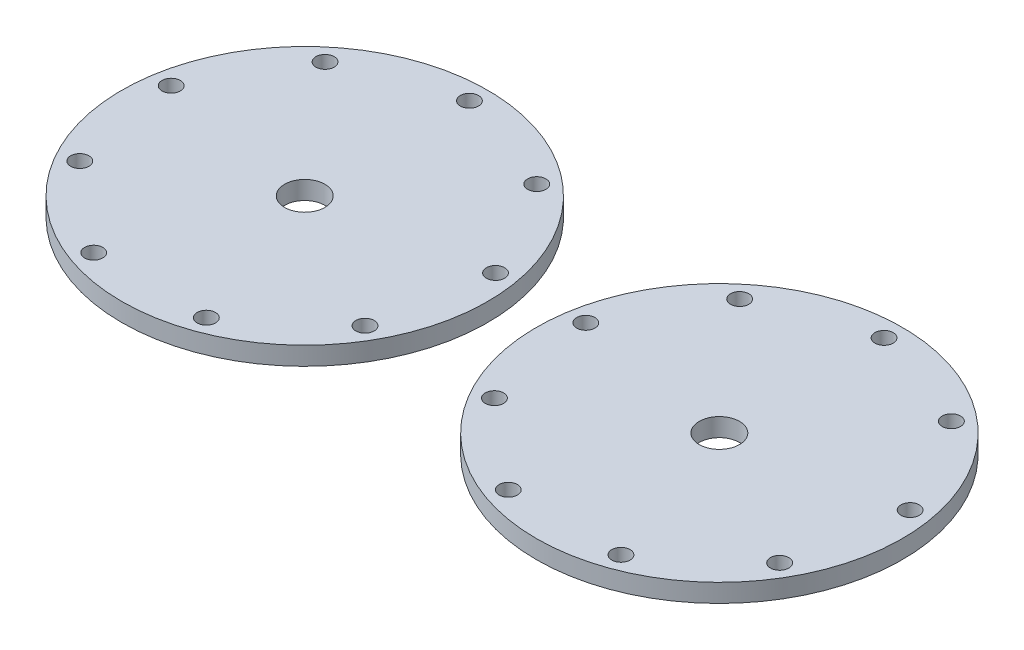
ISO-10303-21;
HEADER;
FILE_DESCRIPTION(('STEP AP214'),'2;1');
FILE_NAME('part.step','',(''),(''),'','','');
FILE_SCHEMA(('AUTOMOTIVE_DESIGN { 1 0 10303 214 1 1 1 1 }'));
ENDSEC;
DATA;
#1=APPLICATION_CONTEXT('core data for automotive mechanical design processes');
#2=APPLICATION_PROTOCOL_DEFINITION('international standard','automotive_design',2000,#1);
#3=PRODUCT_CONTEXT('',#1,'mechanical');
#4=PRODUCT('Part','Part','',(#3));
#5=PRODUCT_RELATED_PRODUCT_CATEGORY('part','',(#4));
#6=PRODUCT_DEFINITION_FORMATION('','',#4);
#7=PRODUCT_DEFINITION_CONTEXT('part definition',#1,'design');
#8=PRODUCT_DEFINITION('design','',#6,#7);
#9=PRODUCT_DEFINITION_SHAPE('','',#8);
#10=(LENGTH_UNIT() NAMED_UNIT(*) SI_UNIT(.MILLI.,.METRE.));
#11=(NAMED_UNIT(*) PLANE_ANGLE_UNIT() SI_UNIT($,.RADIAN.));
#12=(NAMED_UNIT(*) SI_UNIT($,.STERADIAN.) SOLID_ANGLE_UNIT());
#13=UNCERTAINTY_MEASURE_WITH_UNIT(LENGTH_MEASURE(1.E-05),#10,'distance_accuracy_value','');
#14=(GEOMETRIC_REPRESENTATION_CONTEXT(3) GLOBAL_UNCERTAINTY_ASSIGNED_CONTEXT((#13)) GLOBAL_UNIT_ASSIGNED_CONTEXT((#10,
#11,#12)) REPRESENTATION_CONTEXT('',''));
#15=CARTESIAN_POINT('',(0.,0.,0.));
#16=DIRECTION('',(0.,0.,1.));
#17=DIRECTION('',(1.,0.,0.));
#18=AXIS2_PLACEMENT_3D('',#15,#16,#17);
#19=CARTESIAN_POINT('',(-135.319032656499,6.,0.6431512958959));
#20=DIRECTION('',(0.,1.,0.));
#21=DIRECTION('',(0.,0.,1.));
#22=AXIS2_PLACEMENT_3D('',#19,#20,#21);
#23=PLANE('',#22);
#24=CARTESIAN_POINT('',(-188.498651319157,6.,-8.73385029811607));
#25=DIRECTION('',(0.,1.,0.));
#26=DIRECTION('',(0.,0.,1.));
#27=AXIS2_PLACEMENT_3D('',#24,#25,#26);
#28=CIRCLE('',#27,3.00000000000304);
#29=CARTESIAN_POINT('',(-188.498651319157,6.,-5.73385029811303));
#30=VERTEX_POINT('',#29);
#31=EDGE_CURVE('E115',#30,#30,#28,.T.);
#32=ORIENTED_EDGE('',*,*,#31,.F.);
#33=EDGE_LOOP('',(#32));
#34=FACE_BOUND('',#33,.T.);
#35=CARTESIAN_POINT('',(-153.788120396081,6.,51.3865528183357));
#36=DIRECTION('',(0.,1.,0.));
#37=DIRECTION('',(0.,0.,1.));
#38=AXIS2_PLACEMENT_3D('',#35,#36,#37);
#39=CIRCLE('',#38,3.0000000000049);
#40=CARTESIAN_POINT('',(-153.788120396081,6.,54.3865528183406));
#41=VERTEX_POINT('',#40);
#42=EDGE_CURVE('E119',#41,#41,#39,.T.);
#43=ORIENTED_EDGE('',*,*,#42,.F.);
#44=EDGE_LOOP('',(#43));
#45=FACE_BOUND('',#44,.T.);
#46=CARTESIAN_POINT('',(-88.5536608521361,6.,27.6431512958939));
#47=DIRECTION('',(0.,1.,0.));
#48=DIRECTION('',(0.,0.,1.));
#49=AXIS2_PLACEMENT_3D('',#46,#47,#48);
#50=CIRCLE('',#49,3.00000000000295);
#51=CARTESIAN_POINT('',(-88.5536608521361,6.,30.6431512958969));
#52=VERTEX_POINT('',#51);
#53=EDGE_CURVE('E123',#52,#52,#50,.T.);
#54=ORIENTED_EDGE('',*,*,#53,.F.);
#55=EDGE_LOOP('',(#54));
#56=FACE_BOUND('',#55,.T.);
#57=CARTESIAN_POINT('',(-100.608501733426,6.,-40.7232486325304));
#58=DIRECTION('',(0.,1.,0.));
#59=DIRECTION('',(0.,0.,1.));
#60=AXIS2_PLACEMENT_3D('',#57,#58,#59);
#61=CIRCLE('',#60,3.00000000000014);
#62=CARTESIAN_POINT('',(-100.608501733426,6.,-37.7232486325302));
#63=VERTEX_POINT('',#62);
#64=EDGE_CURVE('E81',#63,#63,#61,.T.);
#65=ORIENTED_EDGE('',*,*,#64,.F.);
#66=EDGE_LOOP('',(#65));
#67=FACE_BOUND('',#66,.T.);
#68=CARTESIAN_POINT('',(-135.319032656499,6.,-53.3568487041041));
#69=DIRECTION('',(0.,1.,0.));
#70=DIRECTION('',(0.,0.,1.));
#71=AXIS2_PLACEMENT_3D('',#68,#69,#70);
#72=CIRCLE('',#71,2.99999999999999);
#73=CARTESIAN_POINT('',(-135.319032656499,6.,-50.3568487041041));
#74=VERTEX_POINT('',#73);
#75=EDGE_CURVE('E59',#74,#74,#72,.T.);
#76=ORIENTED_EDGE('',*,*,#75,.F.);
#77=EDGE_LOOP('',(#76));
#78=FACE_BOUND('',#77,.T.);
#79=CARTESIAN_POINT('',(-135.319032656499,6.,0.6431512958959));
#80=DIRECTION('',(0.,1.,0.));
#81=DIRECTION('',(0.,0.,1.));
#82=AXIS2_PLACEMENT_3D('',#79,#80,#81);
#83=CIRCLE('',#82,60.);
#84=CARTESIAN_POINT('',(-135.319032656499,6.,60.6431512958959));
#85=VERTEX_POINT('',#84);
#86=EDGE_CURVE('E12',#85,#85,#83,.T.);
#87=ORIENTED_EDGE('',*,*,#86,.T.);
#88=EDGE_LOOP('',(#87));
#89=FACE_BOUND('',#88,.T.);
#90=CARTESIAN_POINT('',(-135.319032656499,6.,0.6431512958959));
#91=DIRECTION('',(0.,1.,0.));
#92=DIRECTION('',(0.,0.,1.));
#93=AXIS2_PLACEMENT_3D('',#90,#91,#92);
#94=CIRCLE('',#93,6.60000000000001);
#95=CARTESIAN_POINT('',(-135.319032656499,6.,7.24315129589591));
#96=VERTEX_POINT('',#95);
#97=EDGE_CURVE('E72',#96,#96,#94,.T.);
#98=ORIENTED_EDGE('',*,*,#97,.F.);
#99=EDGE_LOOP('',(#98));
#100=FACE_BOUND('',#99,.T.);
#101=CARTESIAN_POINT('',(-82.1394139938381,6.,-8.7338502981206));
#102=DIRECTION('',(0.,1.,0.));
#103=DIRECTION('',(0.,0.,1.));
#104=AXIS2_PLACEMENT_3D('',#101,#102,#103);
#105=CIRCLE('',#104,3.0000000000013);
#106=CARTESIAN_POINT('',(-82.1394139938381,6.,-5.7338502981193));
#107=VERTEX_POINT('',#106);
#108=EDGE_CURVE('E133',#107,#107,#105,.T.);
#109=ORIENTED_EDGE('',*,*,#108,.F.);
#110=EDGE_LOOP('',(#109));
#111=FACE_BOUND('',#110,.T.);
#112=CARTESIAN_POINT('',(-116.849944916909,6.,51.3865528183342));
#113=DIRECTION('',(0.,1.,0.));
#114=DIRECTION('',(0.,0.,1.));
#115=AXIS2_PLACEMENT_3D('',#112,#113,#114);
#116=CIRCLE('',#115,3.00000000000432);
#117=CARTESIAN_POINT('',(-116.849944916909,6.,54.3865528183385));
#118=VERTEX_POINT('',#117);
#119=EDGE_CURVE('E137',#118,#118,#116,.T.);
#120=ORIENTED_EDGE('',*,*,#119,.F.);
#121=EDGE_LOOP('',(#120));
#122=FACE_BOUND('',#121,.T.);
#123=CARTESIAN_POINT('',(-182.084404460855,6.,27.6431512958979));
#124=DIRECTION('',(0.,1.,0.));
#125=DIRECTION('',(0.,0.,1.));
#126=AXIS2_PLACEMENT_3D('',#123,#124,#125);
#127=CIRCLE('',#126,3.00000000000435);
#128=CARTESIAN_POINT('',(-182.084404460855,6.,30.6431512959023));
#129=VERTEX_POINT('',#128);
#130=EDGE_CURVE('E141',#129,#129,#127,.T.);
#131=ORIENTED_EDGE('',*,*,#130,.F.);
#132=EDGE_LOOP('',(#131));
#133=FACE_BOUND('',#132,.T.);
#134=CARTESIAN_POINT('',(-170.029563579572,6.,-40.7232486325274));
#135=DIRECTION('',(0.,1.,0.));
#136=DIRECTION('',(0.,0.,1.));
#137=AXIS2_PLACEMENT_3D('',#134,#135,#136);
#138=CIRCLE('',#137,3.00000000000159);
#139=CARTESIAN_POINT('',(-170.029563579572,6.,-37.7232486325258));
#140=VERTEX_POINT('',#139);
#141=EDGE_CURVE('E144',#140,#140,#138,.T.);
#142=ORIENTED_EDGE('',*,*,#141,.F.);
#143=EDGE_LOOP('',(#142));
#144=FACE_BOUND('',#143,.T.);
#145=ADVANCED_FACE('F45',(#34,#45,#56,#67,#78,#89,#100,#111,#122,#133,#144),#23,.T.);
#146=CARTESIAN_POINT('',(-135.319032656499,0.,0.6431512958959));
#147=DIRECTION('',(0.,1.,0.));
#148=DIRECTION('',(0.,0.,1.));
#149=AXIS2_PLACEMENT_3D('',#146,#147,#148);
#150=PLANE('',#149);
#151=CARTESIAN_POINT('',(-135.319032656499,0.,0.6431512958959));
#152=DIRECTION('',(0.,1.,0.));
#153=DIRECTION('',(0.,0.,1.));
#154=AXIS2_PLACEMENT_3D('',#151,#152,#153);
#155=CIRCLE('',#154,60.);
#156=CARTESIAN_POINT('',(-135.319032656499,0.,60.6431512958959));
#157=VERTEX_POINT('',#156);
#158=EDGE_CURVE('E49',#157,#157,#155,.T.);
#159=ORIENTED_EDGE('',*,*,#158,.F.);
#160=EDGE_LOOP('',(#159));
#161=FACE_BOUND('',#160,.T.);
#162=CARTESIAN_POINT('',(-135.319032656499,0.,-53.3568487041041));
#163=DIRECTION('',(0.,1.,0.));
#164=DIRECTION('',(0.,0.,1.));
#165=AXIS2_PLACEMENT_3D('',#162,#163,#164);
#166=CIRCLE('',#165,2.99999999999999);
#167=CARTESIAN_POINT('',(-135.319032656499,0.,-50.3568487041041));
#168=VERTEX_POINT('',#167);
#169=EDGE_CURVE('E62',#168,#168,#166,.T.);
#170=ORIENTED_EDGE('',*,*,#169,.T.);
#171=EDGE_LOOP('',(#170));
#172=FACE_BOUND('',#171,.T.);
#173=CARTESIAN_POINT('',(-135.319032656499,0.,0.6431512958959));
#174=DIRECTION('',(0.,1.,0.));
#175=DIRECTION('',(0.,0.,1.));
#176=AXIS2_PLACEMENT_3D('',#173,#174,#175);
#177=CIRCLE('',#176,6.60000000000001);
#178=CARTESIAN_POINT('',(-135.319032656499,0.,7.24315129589591));
#179=VERTEX_POINT('',#178);
#180=EDGE_CURVE('E77',#179,#179,#177,.T.);
#181=ORIENTED_EDGE('',*,*,#180,.T.);
#182=EDGE_LOOP('',(#181));
#183=FACE_BOUND('',#182,.T.);
#184=CARTESIAN_POINT('',(-100.608501733426,0.,-40.7232486325304));
#185=DIRECTION('',(0.,1.,0.));
#186=DIRECTION('',(0.,0.,1.));
#187=AXIS2_PLACEMENT_3D('',#184,#185,#186);
#188=CIRCLE('',#187,3.00000000000014);
#189=CARTESIAN_POINT('',(-100.608501733426,0.,-37.7232486325302));
#190=VERTEX_POINT('',#189);
#191=EDGE_CURVE('E78',#190,#190,#188,.T.);
#192=ORIENTED_EDGE('',*,*,#191,.T.);
#193=EDGE_LOOP('',(#192));
#194=FACE_BOUND('',#193,.T.);
#195=CARTESIAN_POINT('',(-82.1394139938381,0.,-8.7338502981206));
#196=DIRECTION('',(0.,1.,0.));
#197=DIRECTION('',(0.,0.,1.));
#198=AXIS2_PLACEMENT_3D('',#195,#196,#197);
#199=CIRCLE('',#198,3.0000000000013);
#200=CARTESIAN_POINT('',(-82.1394139938381,0.,-5.7338502981193));
#201=VERTEX_POINT('',#200);
#202=EDGE_CURVE('E221',#201,#201,#199,.T.);
#203=ORIENTED_EDGE('',*,*,#202,.T.);
#204=EDGE_LOOP('',(#203));
#205=FACE_BOUND('',#204,.T.);
#206=CARTESIAN_POINT('',(-88.5536608521361,0.,27.6431512958939));
#207=DIRECTION('',(0.,1.,0.));
#208=DIRECTION('',(0.,0.,1.));
#209=AXIS2_PLACEMENT_3D('',#206,#207,#208);
#210=CIRCLE('',#209,3.00000000000295);
#211=CARTESIAN_POINT('',(-88.5536608521361,0.,30.6431512958969));
#212=VERTEX_POINT('',#211);
#213=EDGE_CURVE('E176',#212,#212,#210,.T.);
#214=ORIENTED_EDGE('',*,*,#213,.T.);
#215=EDGE_LOOP('',(#214));
#216=FACE_BOUND('',#215,.T.);
#217=CARTESIAN_POINT('',(-116.849944916909,0.,51.3865528183342));
#218=DIRECTION('',(0.,1.,0.));
#219=DIRECTION('',(0.,0.,1.));
#220=AXIS2_PLACEMENT_3D('',#217,#218,#219);
#221=CIRCLE('',#220,3.00000000000432);
#222=CARTESIAN_POINT('',(-116.849944916909,0.,54.3865528183385));
#223=VERTEX_POINT('',#222);
#224=EDGE_CURVE('E169',#223,#223,#221,.T.);
#225=ORIENTED_EDGE('',*,*,#224,.T.);
#226=EDGE_LOOP('',(#225));
#227=FACE_BOUND('',#226,.T.);
#228=CARTESIAN_POINT('',(-153.788120396081,0.,51.3865528183357));
#229=DIRECTION('',(0.,1.,0.));
#230=DIRECTION('',(0.,0.,1.));
#231=AXIS2_PLACEMENT_3D('',#228,#229,#230);
#232=CIRCLE('',#231,3.0000000000049);
#233=CARTESIAN_POINT('',(-153.788120396081,0.,54.3865528183406));
#234=VERTEX_POINT('',#233);
#235=EDGE_CURVE('E170',#234,#234,#232,.T.);
#236=ORIENTED_EDGE('',*,*,#235,.T.);
#237=EDGE_LOOP('',(#236));
#238=FACE_BOUND('',#237,.T.);
#239=CARTESIAN_POINT('',(-182.084404460855,0.,27.6431512958979));
#240=DIRECTION('',(0.,1.,0.));
#241=DIRECTION('',(0.,0.,1.));
#242=AXIS2_PLACEMENT_3D('',#239,#240,#241);
#243=CIRCLE('',#242,3.00000000000435);
#244=CARTESIAN_POINT('',(-182.084404460855,0.,30.6431512959023));
#245=VERTEX_POINT('',#244);
#246=EDGE_CURVE('E158',#245,#245,#243,.T.);
#247=ORIENTED_EDGE('',*,*,#246,.T.);
#248=EDGE_LOOP('',(#247));
#249=FACE_BOUND('',#248,.T.);
#250=CARTESIAN_POINT('',(-188.498651319157,0.,-8.73385029811607));
#251=DIRECTION('',(0.,1.,0.));
#252=DIRECTION('',(0.,0.,1.));
#253=AXIS2_PLACEMENT_3D('',#250,#251,#252);
#254=CIRCLE('',#253,3.00000000000304);
#255=CARTESIAN_POINT('',(-188.498651319157,0.,-5.73385029811303));
#256=VERTEX_POINT('',#255);
#257=EDGE_CURVE('E147',#256,#256,#254,.T.);
#258=ORIENTED_EDGE('',*,*,#257,.T.);
#259=EDGE_LOOP('',(#258));
#260=FACE_BOUND('',#259,.T.);
#261=CARTESIAN_POINT('',(-170.029563579572,0.,-40.7232486325274));
#262=DIRECTION('',(0.,1.,0.));
#263=DIRECTION('',(0.,0.,1.));
#264=AXIS2_PLACEMENT_3D('',#261,#262,#263);
#265=CIRCLE('',#264,3.00000000000159);
#266=CARTESIAN_POINT('',(-170.029563579572,0.,-37.7232486325258));
#267=VERTEX_POINT('',#266);
#268=EDGE_CURVE('E148',#267,#267,#265,.T.);
#269=ORIENTED_EDGE('',*,*,#268,.T.);
#270=EDGE_LOOP('',(#269));
#271=FACE_BOUND('',#270,.T.);
#272=ADVANCED_FACE('F90',(#161,#172,#183,#194,#205,#216,#227,#238,#249,#260,#271),#150,.F.);
#273=CARTESIAN_POINT('',(-135.319032656499,6.,0.6431512958959));
#274=DIRECTION('',(0.,-1.,0.));
#275=DIRECTION('',(0.,0.,-1.));
#276=AXIS2_PLACEMENT_3D('',#273,#274,#275);
#277=CYLINDRICAL_SURFACE('',#276,60.);
#278=ORIENTED_EDGE('',*,*,#86,.F.);
#279=EDGE_LOOP('',(#278));
#280=FACE_BOUND('',#279,.T.);
#281=ORIENTED_EDGE('',*,*,#158,.T.);
#282=EDGE_LOOP('',(#281));
#283=FACE_BOUND('',#282,.T.);
#284=ADVANCED_FACE('F47',(#280,#283),#277,.T.);
#285=CARTESIAN_POINT('',(-135.319032656499,6.,-53.3568487041041));
#286=DIRECTION('',(0.,-1.,0.));
#287=DIRECTION('',(0.,0.,-1.));
#288=AXIS2_PLACEMENT_3D('',#285,#286,#287);
#289=CYLINDRICAL_SURFACE('',#288,2.99999999999999);
#290=ORIENTED_EDGE('',*,*,#75,.T.);
#291=EDGE_LOOP('',(#290));
#292=FACE_BOUND('',#291,.T.);
#293=ORIENTED_EDGE('',*,*,#169,.F.);
#294=EDGE_LOOP('',(#293));
#295=FACE_BOUND('',#294,.T.);
#296=ADVANCED_FACE('F93',(#292,#295),#289,.F.);
#297=CARTESIAN_POINT('',(-135.319032656499,6.,0.6431512958959));
#298=DIRECTION('',(0.,-1.,0.));
#299=DIRECTION('',(0.,0.,-1.));
#300=AXIS2_PLACEMENT_3D('',#297,#298,#299);
#301=CYLINDRICAL_SURFACE('',#300,6.60000000000001);
#302=ORIENTED_EDGE('',*,*,#97,.T.);
#303=EDGE_LOOP('',(#302));
#304=FACE_BOUND('',#303,.T.);
#305=ORIENTED_EDGE('',*,*,#180,.F.);
#306=EDGE_LOOP('',(#305));
#307=FACE_BOUND('',#306,.T.);
#308=ADVANCED_FACE('F95',(#304,#307),#301,.F.);
#309=CARTESIAN_POINT('',(-100.608501733426,6.,-40.7232486325304));
#310=DIRECTION('',(0.,-1.,0.));
#311=DIRECTION('',(0.,0.,-1.));
#312=AXIS2_PLACEMENT_3D('',#309,#310,#311);
#313=CYLINDRICAL_SURFACE('',#312,3.00000000000014);
#314=ORIENTED_EDGE('',*,*,#64,.T.);
#315=EDGE_LOOP('',(#314));
#316=FACE_BOUND('',#315,.T.);
#317=ORIENTED_EDGE('',*,*,#191,.F.);
#318=EDGE_LOOP('',(#317));
#319=FACE_BOUND('',#318,.T.);
#320=ADVANCED_FACE('F101',(#316,#319),#313,.F.);
#321=CARTESIAN_POINT('',(-82.1394139938381,6.,-8.7338502981206));
#322=DIRECTION('',(0.,-1.,0.));
#323=DIRECTION('',(0.,0.,-1.));
#324=AXIS2_PLACEMENT_3D('',#321,#322,#323);
#325=CYLINDRICAL_SURFACE('',#324,3.0000000000013);
#326=ORIENTED_EDGE('',*,*,#108,.T.);
#327=EDGE_LOOP('',(#326));
#328=FACE_BOUND('',#327,.T.);
#329=ORIENTED_EDGE('',*,*,#202,.F.);
#330=EDGE_LOOP('',(#329));
#331=FACE_BOUND('',#330,.T.);
#332=ADVANCED_FACE('F207',(#328,#331),#325,.F.);
#333=CARTESIAN_POINT('',(-88.5536608521361,6.,27.6431512958939));
#334=DIRECTION('',(0.,-1.,0.));
#335=DIRECTION('',(0.,0.,-1.));
#336=AXIS2_PLACEMENT_3D('',#333,#334,#335);
#337=CYLINDRICAL_SURFACE('',#336,3.00000000000295);
#338=ORIENTED_EDGE('',*,*,#53,.T.);
#339=EDGE_LOOP('',(#338));
#340=FACE_BOUND('',#339,.T.);
#341=ORIENTED_EDGE('',*,*,#213,.F.);
#342=EDGE_LOOP('',(#341));
#343=FACE_BOUND('',#342,.T.);
#344=ADVANCED_FACE('F203',(#340,#343),#337,.F.);
#345=CARTESIAN_POINT('',(-116.849944916909,6.,51.3865528183342));
#346=DIRECTION('',(0.,-1.,0.));
#347=DIRECTION('',(0.,0.,-1.));
#348=AXIS2_PLACEMENT_3D('',#345,#346,#347);
#349=CYLINDRICAL_SURFACE('',#348,3.00000000000432);
#350=ORIENTED_EDGE('',*,*,#119,.T.);
#351=EDGE_LOOP('',(#350));
#352=FACE_BOUND('',#351,.T.);
#353=ORIENTED_EDGE('',*,*,#224,.F.);
#354=EDGE_LOOP('',(#353));
#355=FACE_BOUND('',#354,.T.);
#356=ADVANCED_FACE('F196',(#352,#355),#349,.F.);
#357=CARTESIAN_POINT('',(-153.788120396081,6.,51.3865528183357));
#358=DIRECTION('',(0.,-1.,0.));
#359=DIRECTION('',(0.,0.,-1.));
#360=AXIS2_PLACEMENT_3D('',#357,#358,#359);
#361=CYLINDRICAL_SURFACE('',#360,3.0000000000049);
#362=ORIENTED_EDGE('',*,*,#42,.T.);
#363=EDGE_LOOP('',(#362));
#364=FACE_BOUND('',#363,.T.);
#365=ORIENTED_EDGE('',*,*,#235,.F.);
#366=EDGE_LOOP('',(#365));
#367=FACE_BOUND('',#366,.T.);
#368=ADVANCED_FACE('F187',(#364,#367),#361,.F.);
#369=CARTESIAN_POINT('',(-182.084404460855,6.,27.6431512958979));
#370=DIRECTION('',(0.,-1.,0.));
#371=DIRECTION('',(0.,0.,-1.));
#372=AXIS2_PLACEMENT_3D('',#369,#370,#371);
#373=CYLINDRICAL_SURFACE('',#372,3.00000000000435);
#374=ORIENTED_EDGE('',*,*,#130,.T.);
#375=EDGE_LOOP('',(#374));
#376=FACE_BOUND('',#375,.T.);
#377=ORIENTED_EDGE('',*,*,#246,.F.);
#378=EDGE_LOOP('',(#377));
#379=FACE_BOUND('',#378,.T.);
#380=ADVANCED_FACE('F184',(#376,#379),#373,.F.);
#381=CARTESIAN_POINT('',(-188.498651319157,6.,-8.73385029811607));
#382=DIRECTION('',(0.,-1.,0.));
#383=DIRECTION('',(0.,0.,-1.));
#384=AXIS2_PLACEMENT_3D('',#381,#382,#383);
#385=CYLINDRICAL_SURFACE('',#384,3.00000000000304);
#386=ORIENTED_EDGE('',*,*,#31,.T.);
#387=EDGE_LOOP('',(#386));
#388=FACE_BOUND('',#387,.T.);
#389=ORIENTED_EDGE('',*,*,#257,.F.);
#390=EDGE_LOOP('',(#389));
#391=FACE_BOUND('',#390,.T.);
#392=ADVANCED_FACE('F186',(#388,#391),#385,.F.);
#393=CARTESIAN_POINT('',(-170.029563579572,6.,-40.7232486325274));
#394=DIRECTION('',(0.,-1.,0.));
#395=DIRECTION('',(0.,0.,-1.));
#396=AXIS2_PLACEMENT_3D('',#393,#394,#395);
#397=CYLINDRICAL_SURFACE('',#396,3.00000000000159);
#398=ORIENTED_EDGE('',*,*,#141,.T.);
#399=EDGE_LOOP('',(#398));
#400=FACE_BOUND('',#399,.T.);
#401=ORIENTED_EDGE('',*,*,#268,.F.);
#402=EDGE_LOOP('',(#401));
#403=FACE_BOUND('',#402,.T.);
#404=ADVANCED_FACE('F193',(#400,#403),#397,.F.);
#405=CLOSED_SHELL('',(#145,#272,#284,#296,#308,#320,#332,#344,#356,#368,#380,#392,#404));
#406=MANIFOLD_SOLID_BREP('B2',#405);
#407=CARTESIAN_POINT('',(0.,6.,0.));
#408=DIRECTION('',(0.,1.,0.));
#409=DIRECTION('',(0.,0.,1.));
#410=AXIS2_PLACEMENT_3D('',#407,#408,#409);
#411=PLANE('',#410);
#412=CARTESIAN_POINT('',(-53.1796186626573,6.,-9.37700159401196));
#413=DIRECTION('',(0.,1.,0.));
#414=DIRECTION('',(0.,0.,1.));
#415=AXIS2_PLACEMENT_3D('',#412,#413,#414);
#416=CIRCLE('',#415,3.00000000000302);
#417=CARTESIAN_POINT('',(-53.1796186626573,6.,-6.37700159400895));
#418=VERTEX_POINT('',#417);
#419=EDGE_CURVE('E398',#418,#418,#416,.T.);
#420=ORIENTED_EDGE('',*,*,#419,.F.);
#421=EDGE_LOOP('',(#420));
#422=FACE_BOUND('',#421,.T.);
#423=CARTESIAN_POINT('',(-18.4690877395817,6.,50.7434015224398));
#424=DIRECTION('',(0.,1.,0.));
#425=DIRECTION('',(0.,0.,1.));
#426=AXIS2_PLACEMENT_3D('',#423,#424,#425);
#427=CIRCLE('',#426,3.00000000000487);
#428=CARTESIAN_POINT('',(-18.4690877395817,6.,53.7434015224447));
#429=VERTEX_POINT('',#428);
#430=EDGE_CURVE('E402',#429,#429,#427,.T.);
#431=ORIENTED_EDGE('',*,*,#430,.F.);
#432=EDGE_LOOP('',(#431));
#433=FACE_BOUND('',#432,.T.);
#434=CARTESIAN_POINT('',(46.7653718043631,6.,26.999999999998));
#435=DIRECTION('',(0.,1.,0.));
#436=DIRECTION('',(0.,0.,1.));
#437=AXIS2_PLACEMENT_3D('',#434,#435,#436);
#438=CIRCLE('',#437,3.00000000000296);
#439=CARTESIAN_POINT('',(46.7653718043631,6.,30.000000000001));
#440=VERTEX_POINT('',#439);
#441=EDGE_CURVE('E406',#440,#440,#438,.T.);
#442=ORIENTED_EDGE('',*,*,#441,.F.);
#443=EDGE_LOOP('',(#442));
#444=FACE_BOUND('',#443,.T.);
#445=CARTESIAN_POINT('',(34.7105309230737,6.,-41.3663999284263));
#446=DIRECTION('',(0.,1.,0.));
#447=DIRECTION('',(0.,0.,1.));
#448=AXIS2_PLACEMENT_3D('',#445,#446,#447);
#449=CIRCLE('',#448,3.00000000000016);
#450=CARTESIAN_POINT('',(34.7105309230737,6.,-38.3663999284261));
#451=VERTEX_POINT('',#450);
#452=EDGE_CURVE('E364',#451,#451,#449,.T.);
#453=ORIENTED_EDGE('',*,*,#452,.F.);
#454=EDGE_LOOP('',(#453));
#455=FACE_BOUND('',#454,.T.);
#456=CARTESIAN_POINT('',(0.,6.,-54.));
#457=DIRECTION('',(0.,1.,0.));
#458=DIRECTION('',(0.,0.,1.));
#459=AXIS2_PLACEMENT_3D('',#456,#457,#458);
#460=CIRCLE('',#459,3.);
#461=CARTESIAN_POINT('',(0.,6.,-51.));
#462=VERTEX_POINT('',#461);
#463=EDGE_CURVE('E342',#462,#462,#460,.T.);
#464=ORIENTED_EDGE('',*,*,#463,.F.);
#465=EDGE_LOOP('',(#464));
#466=FACE_BOUND('',#465,.T.);
#467=CARTESIAN_POINT('',(0.,6.,0.));
#468=DIRECTION('',(0.,1.,0.));
#469=DIRECTION('',(0.,0.,1.));
#470=AXIS2_PLACEMENT_3D('',#467,#468,#469);
#471=CIRCLE('',#470,60.);
#472=CARTESIAN_POINT('',(0.,6.,60.));
#473=VERTEX_POINT('',#472);
#474=EDGE_CURVE('E44',#473,#473,#471,.T.);
#475=ORIENTED_EDGE('',*,*,#474,.T.);
#476=EDGE_LOOP('',(#475));
#477=FACE_BOUND('',#476,.T.);
#478=CARTESIAN_POINT('',(0.,6.,0.));
#479=DIRECTION('',(0.,1.,0.));
#480=DIRECTION('',(0.,0.,1.));
#481=AXIS2_PLACEMENT_3D('',#478,#479,#480);
#482=CIRCLE('',#481,6.6);
#483=CARTESIAN_POINT('',(0.,6.,6.6));
#484=VERTEX_POINT('',#483);
#485=EDGE_CURVE('E355',#484,#484,#482,.T.);
#486=ORIENTED_EDGE('',*,*,#485,.F.);
#487=EDGE_LOOP('',(#486));
#488=FACE_BOUND('',#487,.T.);
#489=CARTESIAN_POINT('',(53.1796186626611,6.,-9.3770015940165));
#490=DIRECTION('',(0.,1.,0.));
#491=DIRECTION('',(0.,0.,1.));
#492=AXIS2_PLACEMENT_3D('',#489,#490,#491);
#493=CIRCLE('',#492,3.00000000000131);
#494=CARTESIAN_POINT('',(53.1796186626611,6.,-6.37700159401519));
#495=VERTEX_POINT('',#494);
#496=EDGE_CURVE('E416',#495,#495,#493,.T.);
#497=ORIENTED_EDGE('',*,*,#496,.F.);
#498=EDGE_LOOP('',(#497));
#499=FACE_BOUND('',#498,.T.);
#500=CARTESIAN_POINT('',(18.4690877395906,6.,50.7434015224383));
#501=DIRECTION('',(0.,1.,0.));
#502=DIRECTION('',(0.,0.,1.));
#503=AXIS2_PLACEMENT_3D('',#500,#501,#502);
#504=CIRCLE('',#503,3.00000000000434);
#505=CARTESIAN_POINT('',(18.4690877395906,6.,53.7434015224426));
#506=VERTEX_POINT('',#505);
#507=EDGE_CURVE('E420',#506,#506,#504,.T.);
#508=ORIENTED_EDGE('',*,*,#507,.F.);
#509=EDGE_LOOP('',(#508));
#510=FACE_BOUND('',#509,.T.);
#511=CARTESIAN_POINT('',(-46.7653718043562,6.,27.000000000002));
#512=DIRECTION('',(0.,1.,0.));
#513=DIRECTION('',(0.,0.,1.));
#514=AXIS2_PLACEMENT_3D('',#511,#512,#513);
#515=CIRCLE('',#514,3.00000000000435);
#516=CARTESIAN_POINT('',(-46.7653718043562,6.,30.0000000000064));
#517=VERTEX_POINT('',#516);
#518=EDGE_CURVE('E424',#517,#517,#515,.T.);
#519=ORIENTED_EDGE('',*,*,#518,.F.);
#520=EDGE_LOOP('',(#519));
#521=FACE_BOUND('',#520,.T.);
#522=CARTESIAN_POINT('',(-34.7105309230726,6.,-41.3663999284233));
#523=DIRECTION('',(0.,1.,0.));
#524=DIRECTION('',(0.,0.,1.));
#525=AXIS2_PLACEMENT_3D('',#522,#523,#524);
#526=CIRCLE('',#525,3.00000000000159);
#527=CARTESIAN_POINT('',(-34.7105309230726,6.,-38.3663999284217));
#528=VERTEX_POINT('',#527);
#529=EDGE_CURVE('E427',#528,#528,#526,.T.);
#530=ORIENTED_EDGE('',*,*,#529,.F.);
#531=EDGE_LOOP('',(#530));
#532=FACE_BOUND('',#531,.T.);
#533=ADVANCED_FACE('F328',(#422,#433,#444,#455,#466,#477,#488,#499,#510,#521,#532),#411,.T.);
#534=CARTESIAN_POINT('',(0.,0.,0.));
#535=DIRECTION('',(0.,1.,0.));
#536=DIRECTION('',(0.,0.,1.));
#537=AXIS2_PLACEMENT_3D('',#534,#535,#536);
#538=PLANE('',#537);
#539=CARTESIAN_POINT('',(0.,0.,0.));
#540=DIRECTION('',(0.,1.,0.));
#541=DIRECTION('',(0.,0.,1.));
#542=AXIS2_PLACEMENT_3D('',#539,#540,#541);
#543=CIRCLE('',#542,60.);
#544=CARTESIAN_POINT('',(0.,0.,60.));
#545=VERTEX_POINT('',#544);
#546=EDGE_CURVE('E332',#545,#545,#543,.T.);
#547=ORIENTED_EDGE('',*,*,#546,.F.);
#548=EDGE_LOOP('',(#547));
#549=FACE_BOUND('',#548,.T.);
#550=CARTESIAN_POINT('',(0.,0.,-54.));
#551=DIRECTION('',(0.,1.,0.));
#552=DIRECTION('',(0.,0.,1.));
#553=AXIS2_PLACEMENT_3D('',#550,#551,#552);
#554=CIRCLE('',#553,3.);
#555=CARTESIAN_POINT('',(0.,0.,-51.));
#556=VERTEX_POINT('',#555);
#557=EDGE_CURVE('E345',#556,#556,#554,.T.);
#558=ORIENTED_EDGE('',*,*,#557,.T.);
#559=EDGE_LOOP('',(#558));
#560=FACE_BOUND('',#559,.T.);
#561=CARTESIAN_POINT('',(0.,0.,0.));
#562=DIRECTION('',(0.,1.,0.));
#563=DIRECTION('',(0.,0.,1.));
#564=AXIS2_PLACEMENT_3D('',#561,#562,#563);
#565=CIRCLE('',#564,6.6);
#566=CARTESIAN_POINT('',(0.,0.,6.6));
#567=VERTEX_POINT('',#566);
#568=EDGE_CURVE('E360',#567,#567,#565,.T.);
#569=ORIENTED_EDGE('',*,*,#568,.T.);
#570=EDGE_LOOP('',(#569));
#571=FACE_BOUND('',#570,.T.);
#572=CARTESIAN_POINT('',(34.7105309230737,0.,-41.3663999284263));
#573=DIRECTION('',(0.,1.,0.));
#574=DIRECTION('',(0.,0.,1.));
#575=AXIS2_PLACEMENT_3D('',#572,#573,#574);
#576=CIRCLE('',#575,3.00000000000016);
#577=CARTESIAN_POINT('',(34.7105309230737,0.,-38.3663999284261));
#578=VERTEX_POINT('',#577);
#579=EDGE_CURVE('E361',#578,#578,#576,.T.);
#580=ORIENTED_EDGE('',*,*,#579,.T.);
#581=EDGE_LOOP('',(#580));
#582=FACE_BOUND('',#581,.T.);
#583=CARTESIAN_POINT('',(53.1796186626611,0.,-9.3770015940165));
#584=DIRECTION('',(0.,1.,0.));
#585=DIRECTION('',(0.,0.,1.));
#586=AXIS2_PLACEMENT_3D('',#583,#584,#585);
#587=CIRCLE('',#586,3.00000000000131);
#588=CARTESIAN_POINT('',(53.1796186626611,0.,-6.37700159401519));
#589=VERTEX_POINT('',#588);
#590=EDGE_CURVE('E504',#589,#589,#587,.T.);
#591=ORIENTED_EDGE('',*,*,#590,.T.);
#592=EDGE_LOOP('',(#591));
#593=FACE_BOUND('',#592,.T.);
#594=CARTESIAN_POINT('',(46.7653718043631,0.,26.999999999998));
#595=DIRECTION('',(0.,1.,0.));
#596=DIRECTION('',(0.,0.,1.));
#597=AXIS2_PLACEMENT_3D('',#594,#595,#596);
#598=CIRCLE('',#597,3.00000000000296);
#599=CARTESIAN_POINT('',(46.7653718043631,0.,30.000000000001));
#600=VERTEX_POINT('',#599);
#601=EDGE_CURVE('E459',#600,#600,#598,.T.);
#602=ORIENTED_EDGE('',*,*,#601,.T.);
#603=EDGE_LOOP('',(#602));
#604=FACE_BOUND('',#603,.T.);
#605=CARTESIAN_POINT('',(18.4690877395906,0.,50.7434015224383));
#606=DIRECTION('',(0.,1.,0.));
#607=DIRECTION('',(0.,0.,1.));
#608=AXIS2_PLACEMENT_3D('',#605,#606,#607);
#609=CIRCLE('',#608,3.00000000000434);
#610=CARTESIAN_POINT('',(18.4690877395906,0.,53.7434015224426));
#611=VERTEX_POINT('',#610);
#612=EDGE_CURVE('E452',#611,#611,#609,.T.);
#613=ORIENTED_EDGE('',*,*,#612,.T.);
#614=EDGE_LOOP('',(#613));
#615=FACE_BOUND('',#614,.T.);
#616=CARTESIAN_POINT('',(-18.4690877395817,0.,50.7434015224398));
#617=DIRECTION('',(0.,1.,0.));
#618=DIRECTION('',(0.,0.,1.));
#619=AXIS2_PLACEMENT_3D('',#616,#617,#618);
#620=CIRCLE('',#619,3.00000000000487);
#621=CARTESIAN_POINT('',(-18.4690877395817,0.,53.7434015224447));
#622=VERTEX_POINT('',#621);
#623=EDGE_CURVE('E453',#622,#622,#620,.T.);
#624=ORIENTED_EDGE('',*,*,#623,.T.);
#625=EDGE_LOOP('',(#624));
#626=FACE_BOUND('',#625,.T.);
#627=CARTESIAN_POINT('',(-46.7653718043562,0.,27.000000000002));
#628=DIRECTION('',(0.,1.,0.));
#629=DIRECTION('',(0.,0.,1.));
#630=AXIS2_PLACEMENT_3D('',#627,#628,#629);
#631=CIRCLE('',#630,3.00000000000435);
#632=CARTESIAN_POINT('',(-46.7653718043562,0.,30.0000000000064));
#633=VERTEX_POINT('',#632);
#634=EDGE_CURVE('E441',#633,#633,#631,.T.);
#635=ORIENTED_EDGE('',*,*,#634,.T.);
#636=EDGE_LOOP('',(#635));
#637=FACE_BOUND('',#636,.T.);
#638=CARTESIAN_POINT('',(-53.1796186626573,0.,-9.37700159401196));
#639=DIRECTION('',(0.,1.,0.));
#640=DIRECTION('',(0.,0.,1.));
#641=AXIS2_PLACEMENT_3D('',#638,#639,#640);
#642=CIRCLE('',#641,3.00000000000302);
#643=CARTESIAN_POINT('',(-53.1796186626573,0.,-6.37700159400895));
#644=VERTEX_POINT('',#643);
#645=EDGE_CURVE('E430',#644,#644,#642,.T.);
#646=ORIENTED_EDGE('',*,*,#645,.T.);
#647=EDGE_LOOP('',(#646));
#648=FACE_BOUND('',#647,.T.);
#649=CARTESIAN_POINT('',(-34.7105309230726,0.,-41.3663999284233));
#650=DIRECTION('',(0.,1.,0.));
#651=DIRECTION('',(0.,0.,1.));
#652=AXIS2_PLACEMENT_3D('',#649,#650,#651);
#653=CIRCLE('',#652,3.00000000000159);
#654=CARTESIAN_POINT('',(-34.7105309230726,0.,-38.3663999284217));
#655=VERTEX_POINT('',#654);
#656=EDGE_CURVE('E431',#655,#655,#653,.T.);
#657=ORIENTED_EDGE('',*,*,#656,.T.);
#658=EDGE_LOOP('',(#657));
#659=FACE_BOUND('',#658,.T.);
#660=ADVANCED_FACE('F373',(#549,#560,#571,#582,#593,#604,#615,#626,#637,#648,#659),#538,.F.);
#661=CARTESIAN_POINT('',(0.,6.,0.));
#662=DIRECTION('',(0.,-1.,0.));
#663=DIRECTION('',(0.,0.,-1.));
#664=AXIS2_PLACEMENT_3D('',#661,#662,#663);
#665=CYLINDRICAL_SURFACE('',#664,60.);
#666=ORIENTED_EDGE('',*,*,#474,.F.);
#667=EDGE_LOOP('',(#666));
#668=FACE_BOUND('',#667,.T.);
#669=ORIENTED_EDGE('',*,*,#546,.T.);
#670=EDGE_LOOP('',(#669));
#671=FACE_BOUND('',#670,.T.);
#672=ADVANCED_FACE('F330',(#668,#671),#665,.T.);
#673=CARTESIAN_POINT('',(0.,6.,-54.));
#674=DIRECTION('',(0.,-1.,0.));
#675=DIRECTION('',(0.,0.,-1.));
#676=AXIS2_PLACEMENT_3D('',#673,#674,#675);
#677=CYLINDRICAL_SURFACE('',#676,3.);
#678=ORIENTED_EDGE('',*,*,#463,.T.);
#679=EDGE_LOOP('',(#678));
#680=FACE_BOUND('',#679,.T.);
#681=ORIENTED_EDGE('',*,*,#557,.F.);
#682=EDGE_LOOP('',(#681));
#683=FACE_BOUND('',#682,.T.);
#684=ADVANCED_FACE('F376',(#680,#683),#677,.F.);
#685=CARTESIAN_POINT('',(0.,6.,0.));
#686=DIRECTION('',(0.,-1.,0.));
#687=DIRECTION('',(0.,0.,-1.));
#688=AXIS2_PLACEMENT_3D('',#685,#686,#687);
#689=CYLINDRICAL_SURFACE('',#688,6.6);
#690=ORIENTED_EDGE('',*,*,#485,.T.);
#691=EDGE_LOOP('',(#690));
#692=FACE_BOUND('',#691,.T.);
#693=ORIENTED_EDGE('',*,*,#568,.F.);
#694=EDGE_LOOP('',(#693));
#695=FACE_BOUND('',#694,.T.);
#696=ADVANCED_FACE('F378',(#692,#695),#689,.F.);
#697=CARTESIAN_POINT('',(34.7105309230737,6.,-41.3663999284263));
#698=DIRECTION('',(0.,-1.,0.));
#699=DIRECTION('',(0.,0.,-1.));
#700=AXIS2_PLACEMENT_3D('',#697,#698,#699);
#701=CYLINDRICAL_SURFACE('',#700,3.00000000000016);
#702=ORIENTED_EDGE('',*,*,#452,.T.);
#703=EDGE_LOOP('',(#702));
#704=FACE_BOUND('',#703,.T.);
#705=ORIENTED_EDGE('',*,*,#579,.F.);
#706=EDGE_LOOP('',(#705));
#707=FACE_BOUND('',#706,.T.);
#708=ADVANCED_FACE('F384',(#704,#707),#701,.F.);
#709=CARTESIAN_POINT('',(53.1796186626611,6.,-9.3770015940165));
#710=DIRECTION('',(0.,-1.,0.));
#711=DIRECTION('',(0.,0.,-1.));
#712=AXIS2_PLACEMENT_3D('',#709,#710,#711);
#713=CYLINDRICAL_SURFACE('',#712,3.00000000000131);
#714=ORIENTED_EDGE('',*,*,#496,.T.);
#715=EDGE_LOOP('',(#714));
#716=FACE_BOUND('',#715,.T.);
#717=ORIENTED_EDGE('',*,*,#590,.F.);
#718=EDGE_LOOP('',(#717));
#719=FACE_BOUND('',#718,.T.);
#720=ADVANCED_FACE('F490',(#716,#719),#713,.F.);
#721=CARTESIAN_POINT('',(46.7653718043631,6.,26.999999999998));
#722=DIRECTION('',(0.,-1.,0.));
#723=DIRECTION('',(0.,0.,-1.));
#724=AXIS2_PLACEMENT_3D('',#721,#722,#723);
#725=CYLINDRICAL_SURFACE('',#724,3.00000000000296);
#726=ORIENTED_EDGE('',*,*,#441,.T.);
#727=EDGE_LOOP('',(#726));
#728=FACE_BOUND('',#727,.T.);
#729=ORIENTED_EDGE('',*,*,#601,.F.);
#730=EDGE_LOOP('',(#729));
#731=FACE_BOUND('',#730,.T.);
#732=ADVANCED_FACE('F486',(#728,#731),#725,.F.);
#733=CARTESIAN_POINT('',(18.4690877395906,6.,50.7434015224383));
#734=DIRECTION('',(0.,-1.,0.));
#735=DIRECTION('',(0.,0.,-1.));
#736=AXIS2_PLACEMENT_3D('',#733,#734,#735);
#737=CYLINDRICAL_SURFACE('',#736,3.00000000000434);
#738=ORIENTED_EDGE('',*,*,#507,.T.);
#739=EDGE_LOOP('',(#738));
#740=FACE_BOUND('',#739,.T.);
#741=ORIENTED_EDGE('',*,*,#612,.F.);
#742=EDGE_LOOP('',(#741));
#743=FACE_BOUND('',#742,.T.);
#744=ADVANCED_FACE('F479',(#740,#743),#737,.F.);
#745=CARTESIAN_POINT('',(-18.4690877395817,6.,50.7434015224398));
#746=DIRECTION('',(0.,-1.,0.));
#747=DIRECTION('',(0.,0.,-1.));
#748=AXIS2_PLACEMENT_3D('',#745,#746,#747);
#749=CYLINDRICAL_SURFACE('',#748,3.00000000000487);
#750=ORIENTED_EDGE('',*,*,#430,.T.);
#751=EDGE_LOOP('',(#750));
#752=FACE_BOUND('',#751,.T.);
#753=ORIENTED_EDGE('',*,*,#623,.F.);
#754=EDGE_LOOP('',(#753));
#755=FACE_BOUND('',#754,.T.);
#756=ADVANCED_FACE('F470',(#752,#755),#749,.F.);
#757=CARTESIAN_POINT('',(-46.7653718043562,6.,27.000000000002));
#758=DIRECTION('',(0.,-1.,0.));
#759=DIRECTION('',(0.,0.,-1.));
#760=AXIS2_PLACEMENT_3D('',#757,#758,#759);
#761=CYLINDRICAL_SURFACE('',#760,3.00000000000435);
#762=ORIENTED_EDGE('',*,*,#518,.T.);
#763=EDGE_LOOP('',(#762));
#764=FACE_BOUND('',#763,.T.);
#765=ORIENTED_EDGE('',*,*,#634,.F.);
#766=EDGE_LOOP('',(#765));
#767=FACE_BOUND('',#766,.T.);
#768=ADVANCED_FACE('F467',(#764,#767),#761,.F.);
#769=CARTESIAN_POINT('',(-53.1796186626573,6.,-9.37700159401196));
#770=DIRECTION('',(0.,-1.,0.));
#771=DIRECTION('',(0.,0.,-1.));
#772=AXIS2_PLACEMENT_3D('',#769,#770,#771);
#773=CYLINDRICAL_SURFACE('',#772,3.00000000000302);
#774=ORIENTED_EDGE('',*,*,#419,.T.);
#775=EDGE_LOOP('',(#774));
#776=FACE_BOUND('',#775,.T.);
#777=ORIENTED_EDGE('',*,*,#645,.F.);
#778=EDGE_LOOP('',(#777));
#779=FACE_BOUND('',#778,.T.);
#780=ADVANCED_FACE('F469',(#776,#779),#773,.F.);
#781=CARTESIAN_POINT('',(-34.7105309230726,6.,-41.3663999284233));
#782=DIRECTION('',(0.,-1.,0.));
#783=DIRECTION('',(0.,0.,-1.));
#784=AXIS2_PLACEMENT_3D('',#781,#782,#783);
#785=CYLINDRICAL_SURFACE('',#784,3.00000000000159);
#786=ORIENTED_EDGE('',*,*,#529,.T.);
#787=EDGE_LOOP('',(#786));
#788=FACE_BOUND('',#787,.T.);
#789=ORIENTED_EDGE('',*,*,#656,.F.);
#790=EDGE_LOOP('',(#789));
#791=FACE_BOUND('',#790,.T.);
#792=ADVANCED_FACE('F476',(#788,#791),#785,.F.);
#793=CLOSED_SHELL('',(#533,#660,#672,#684,#696,#708,#720,#732,#744,#756,#768,#780,#792));
#794=MANIFOLD_SOLID_BREP('B7',#793);
#795=ADVANCED_BREP_SHAPE_REPRESENTATION('',(#18,#406,#794),#14);
#796=SHAPE_DEFINITION_REPRESENTATION(#9,#795);
ENDSEC;
END-ISO-10303-21;
